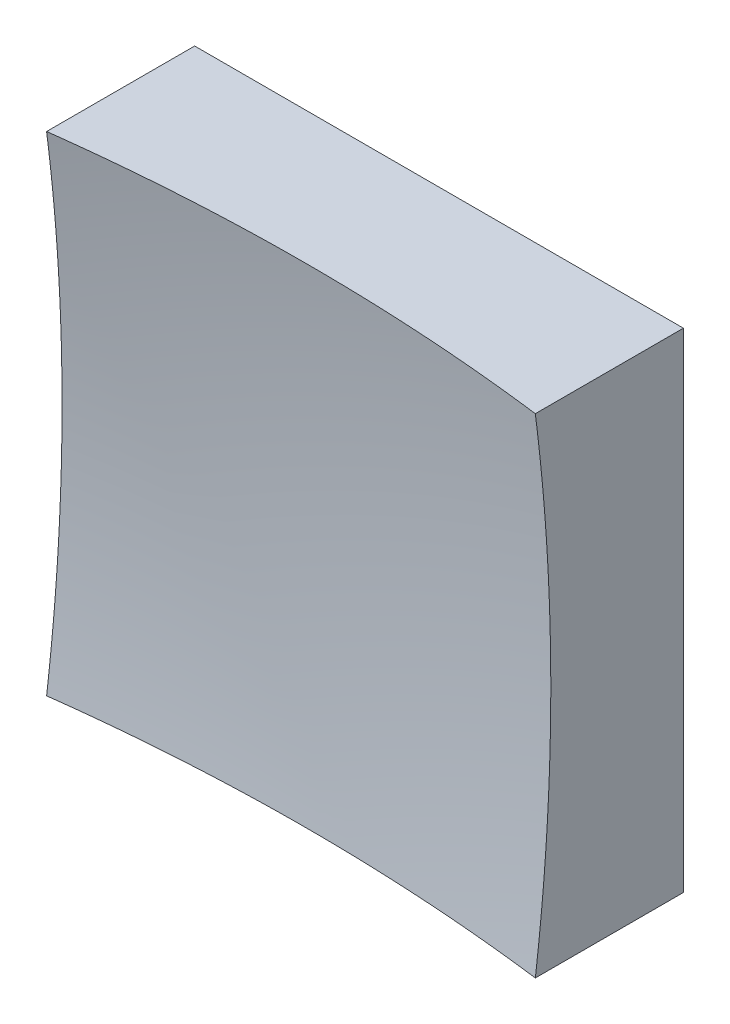
ISO-10303-21;
HEADER;
FILE_DESCRIPTION(('STEP AP214'),'2;1');
FILE_NAME('part.step','',(''),(''),'','','');
FILE_SCHEMA(('AUTOMOTIVE_DESIGN { 1 0 10303 214 1 1 1 1 }'));
ENDSEC;
DATA;
#1=APPLICATION_CONTEXT('core data for automotive mechanical design processes');
#2=APPLICATION_PROTOCOL_DEFINITION('international standard','automotive_design',2000,#1);
#3=PRODUCT_CONTEXT('',#1,'mechanical');
#4=PRODUCT('Part','Part','',(#3));
#5=PRODUCT_RELATED_PRODUCT_CATEGORY('part','',(#4));
#6=PRODUCT_DEFINITION_FORMATION('','',#4);
#7=PRODUCT_DEFINITION_CONTEXT('part definition',#1,'design');
#8=PRODUCT_DEFINITION('design','',#6,#7);
#9=PRODUCT_DEFINITION_SHAPE('','',#8);
#10=(LENGTH_UNIT() NAMED_UNIT(*) SI_UNIT(.MILLI.,.METRE.));
#11=(NAMED_UNIT(*) PLANE_ANGLE_UNIT() SI_UNIT($,.RADIAN.));
#12=(NAMED_UNIT(*) SI_UNIT($,.STERADIAN.) SOLID_ANGLE_UNIT());
#13=UNCERTAINTY_MEASURE_WITH_UNIT(LENGTH_MEASURE(1.E-05),#10,'distance_accuracy_value','');
#14=(GEOMETRIC_REPRESENTATION_CONTEXT(3) GLOBAL_UNCERTAINTY_ASSIGNED_CONTEXT((#13)) GLOBAL_UNIT_ASSIGNED_CONTEXT((#10,
#11,#12)) REPRESENTATION_CONTEXT('',''));
#15=CARTESIAN_POINT('',(0.,0.,0.));
#16=DIRECTION('',(0.,0.,1.));
#17=DIRECTION('',(1.,0.,0.));
#18=AXIS2_PLACEMENT_3D('',#15,#16,#17);
#19=CARTESIAN_POINT('',(-6.25,6.25,10.));
#20=DIRECTION('',(0.,1.,0.));
#21=DIRECTION('',(0.,0.,1.));
#22=AXIS2_PLACEMENT_3D('',#19,#20,#21);
#23=PLANE('',#22);
#24=CARTESIAN_POINT('',(0.,6.25,53.));
#25=DIRECTION('',(0.,1.,0.));
#26=DIRECTION('',(0.,0.,1.));
#27=AXIS2_PLACEMENT_3D('',#24,#25,#26);
#28=CIRCLE('',#27,49.6078370824611);
#29=CARTESIAN_POINT('',(6.25,6.25,3.78745078742618));
#30=VERTEX_POINT('',#29);
#31=CARTESIAN_POINT('',(-6.25,6.25,3.78745078742618));
#32=VERTEX_POINT('',#31);
#33=EDGE_CURVE('E79',#30,#32,#28,.T.);
#34=ORIENTED_EDGE('',*,*,#33,.F.);
#35=DIRECTION('',(0.,0.,-1.));
#36=VECTOR('',#35,1.);
#37=CARTESIAN_POINT('',(6.25,6.25,10.));
#38=LINE('',#37,#36);
#39=CARTESIAN_POINT('',(6.25,6.25,0.));
#40=VERTEX_POINT('',#39);
#41=EDGE_CURVE('E85',#30,#40,#38,.T.);
#42=ORIENTED_EDGE('',*,*,#41,.T.);
#43=DIRECTION('',(1.,0.,0.));
#44=VECTOR('',#43,1.);
#45=CARTESIAN_POINT('',(-6.25,6.25,0.));
#46=LINE('',#45,#44);
#47=CARTESIAN_POINT('',(-6.25,6.25,0.));
#48=VERTEX_POINT('',#47);
#49=EDGE_CURVE('E88',#48,#40,#46,.T.);
#50=ORIENTED_EDGE('',*,*,#49,.F.);
#51=DIRECTION('',(0.,0.,-1.));
#52=VECTOR('',#51,1.);
#53=CARTESIAN_POINT('',(-6.25,6.25,10.));
#54=LINE('',#53,#52);
#55=EDGE_CURVE('E47',#32,#48,#54,.T.);
#56=ORIENTED_EDGE('',*,*,#55,.F.);
#57=EDGE_LOOP('',(#34,#42,#50,#56));
#58=FACE_BOUND('',#57,.T.);
#59=ADVANCED_FACE('F39',(#58),#23,.T.);
#60=CARTESIAN_POINT('',(-6.25,6.25,10.));
#61=DIRECTION('',(1.,0.,0.));
#62=DIRECTION('',(0.,0.,-1.));
#63=AXIS2_PLACEMENT_3D('',#60,#61,#62);
#64=PLANE('',#63);
#65=DIRECTION('',(0.,0.,-1.));
#66=VECTOR('',#65,1.);
#67=CARTESIAN_POINT('',(-6.25,-6.25,10.));
#68=LINE('',#67,#66);
#69=CARTESIAN_POINT('',(-6.25,-6.25,3.78745078742618));
#70=VERTEX_POINT('',#69);
#71=CARTESIAN_POINT('',(-6.25,-6.25,0.));
#72=VERTEX_POINT('',#71);
#73=EDGE_CURVE('E100',#70,#72,#68,.T.);
#74=ORIENTED_EDGE('',*,*,#73,.F.);
#75=CARTESIAN_POINT('',(-6.25,0.,53.));
#76=DIRECTION('',(1.,0.,0.));
#77=DIRECTION('',(0.,0.,-1.));
#78=AXIS2_PLACEMENT_3D('',#75,#76,#77);
#79=CIRCLE('',#78,49.6078370824611);
#80=EDGE_CURVE('E89',#70,#32,#79,.T.);
#81=ORIENTED_EDGE('',*,*,#80,.T.);
#82=ORIENTED_EDGE('',*,*,#55,.T.);
#83=DIRECTION('',(0.,-1.,0.));
#84=VECTOR('',#83,1.);
#85=CARTESIAN_POINT('',(-6.25,6.25,0.));
#86=LINE('',#85,#84);
#87=EDGE_CURVE('E97',#48,#72,#86,.T.);
#88=ORIENTED_EDGE('',*,*,#87,.T.);
#89=EDGE_LOOP('',(#74,#81,#82,#88));
#90=FACE_BOUND('',#89,.T.);
#91=ADVANCED_FACE('F122',(#90),#64,.F.);
#92=CARTESIAN_POINT('',(-6.25,-6.25,10.));
#93=DIRECTION('',(0.,1.,0.));
#94=DIRECTION('',(0.,0.,1.));
#95=AXIS2_PLACEMENT_3D('',#92,#93,#94);
#96=PLANE('',#95);
#97=DIRECTION('',(0.,0.,-1.));
#98=VECTOR('',#97,1.);
#99=CARTESIAN_POINT('',(6.25,-6.25,10.));
#100=LINE('',#99,#98);
#101=CARTESIAN_POINT('',(6.25,-6.25,3.78745078742618));
#102=VERTEX_POINT('',#101);
#103=CARTESIAN_POINT('',(6.25,-6.25,0.));
#104=VERTEX_POINT('',#103);
#105=EDGE_CURVE('E96',#102,#104,#100,.T.);
#106=ORIENTED_EDGE('',*,*,#105,.F.);
#107=CARTESIAN_POINT('',(0.,-6.25,53.));
#108=DIRECTION('',(0.,1.,0.));
#109=DIRECTION('',(0.,0.,1.));
#110=AXIS2_PLACEMENT_3D('',#107,#108,#109);
#111=CIRCLE('',#110,49.6078370824611);
#112=EDGE_CURVE('E53',#102,#70,#111,.T.);
#113=ORIENTED_EDGE('',*,*,#112,.T.);
#114=ORIENTED_EDGE('',*,*,#73,.T.);
#115=DIRECTION('',(1.,0.,0.));
#116=VECTOR('',#115,1.);
#117=CARTESIAN_POINT('',(-6.25,-6.25,0.));
#118=LINE('',#117,#116);
#119=EDGE_CURVE('E102',#72,#104,#118,.T.);
#120=ORIENTED_EDGE('',*,*,#119,.T.);
#121=EDGE_LOOP('',(#106,#113,#114,#120));
#122=FACE_BOUND('',#121,.T.);
#123=ADVANCED_FACE('F121',(#122),#96,.F.);
#124=CARTESIAN_POINT('',(6.25,6.25,10.));
#125=DIRECTION('',(1.,0.,0.));
#126=DIRECTION('',(0.,0.,-1.));
#127=AXIS2_PLACEMENT_3D('',#124,#125,#126);
#128=PLANE('',#127);
#129=CARTESIAN_POINT('',(6.25,0.,53.));
#130=DIRECTION('',(1.,0.,0.));
#131=DIRECTION('',(0.,0.,-1.));
#132=AXIS2_PLACEMENT_3D('',#129,#130,#131);
#133=CIRCLE('',#132,49.6078370824611);
#134=EDGE_CURVE('E11',#102,#30,#133,.T.);
#135=ORIENTED_EDGE('',*,*,#134,.F.);
#136=ORIENTED_EDGE('',*,*,#105,.T.);
#137=DIRECTION('',(0.,-1.,0.));
#138=VECTOR('',#137,1.);
#139=CARTESIAN_POINT('',(6.25,6.25,0.));
#140=LINE('',#139,#138);
#141=EDGE_CURVE('E93',#40,#104,#140,.T.);
#142=ORIENTED_EDGE('',*,*,#141,.F.);
#143=ORIENTED_EDGE('',*,*,#41,.F.);
#144=EDGE_LOOP('',(#135,#136,#142,#143));
#145=FACE_BOUND('',#144,.T.);
#146=ADVANCED_FACE('F91',(#145),#128,.T.);
#147=CARTESIAN_POINT('',(0.,0.,0.));
#148=DIRECTION('',(0.,0.,-1.));
#149=DIRECTION('',(-1.,0.,0.));
#150=AXIS2_PLACEMENT_3D('',#147,#148,#149);
#151=PLANE('',#150);
#152=ORIENTED_EDGE('',*,*,#49,.T.);
#153=ORIENTED_EDGE('',*,*,#141,.T.);
#154=ORIENTED_EDGE('',*,*,#119,.F.);
#155=ORIENTED_EDGE('',*,*,#87,.F.);
#156=EDGE_LOOP('',(#152,#153,#154,#155));
#157=FACE_BOUND('',#156,.T.);
#158=ADVANCED_FACE('F125',(#157),#151,.T.);
#159=CARTESIAN_POINT('',(0.,0.,53.));
#160=DIRECTION('',(0.,0.,1.));
#161=DIRECTION('',(1.,0.,0.));
#162=AXIS2_PLACEMENT_3D('',#159,#160,#161);
#163=SPHERICAL_SURFACE('',#162,50.);
#164=ORIENTED_EDGE('',*,*,#33,.T.);
#165=ORIENTED_EDGE('',*,*,#80,.F.);
#166=ORIENTED_EDGE('',*,*,#112,.F.);
#167=ORIENTED_EDGE('',*,*,#134,.T.);
#168=EDGE_LOOP('',(#164,#165,#166,#167));
#169=FACE_BOUND('',#168,.T.);
#170=ADVANCED_FACE('F78',(#169),#163,.F.);
#171=CLOSED_SHELL('',(#59,#91,#123,#146,#158,#170));
#172=MANIFOLD_SOLID_BREP('B2',#171);
#173=ADVANCED_BREP_SHAPE_REPRESENTATION('',(#18,#172),#14);
#174=SHAPE_DEFINITION_REPRESENTATION(#9,#173);
ENDSEC;
END-ISO-10303-21;
